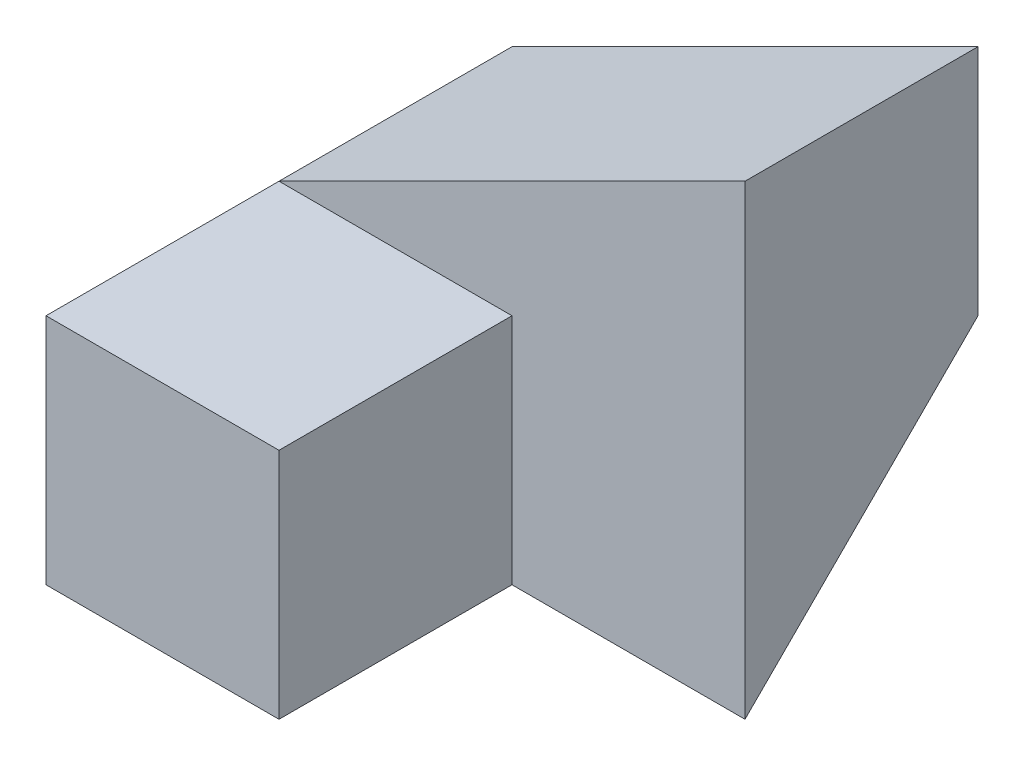
ISO-10303-21;
HEADER;
FILE_DESCRIPTION(('STEP AP214'),'2;1');
FILE_NAME('part.step','',(''),(''),'','','');
FILE_SCHEMA(('AUTOMOTIVE_DESIGN { 1 0 10303 214 1 1 1 1 }'));
ENDSEC;
DATA;
#1=APPLICATION_CONTEXT('core data for automotive mechanical design processes');
#2=APPLICATION_PROTOCOL_DEFINITION('international standard','automotive_design',2000,#1);
#3=PRODUCT_CONTEXT('',#1,'mechanical');
#4=PRODUCT('Part','Part','',(#3));
#5=PRODUCT_RELATED_PRODUCT_CATEGORY('part','',(#4));
#6=PRODUCT_DEFINITION_FORMATION('','',#4);
#7=PRODUCT_DEFINITION_CONTEXT('part definition',#1,'design');
#8=PRODUCT_DEFINITION('design','',#6,#7);
#9=PRODUCT_DEFINITION_SHAPE('','',#8);
#10=(LENGTH_UNIT() NAMED_UNIT(*) SI_UNIT(.MILLI.,.METRE.));
#11=(NAMED_UNIT(*) PLANE_ANGLE_UNIT() SI_UNIT($,.RADIAN.));
#12=(NAMED_UNIT(*) SI_UNIT($,.STERADIAN.) SOLID_ANGLE_UNIT());
#13=UNCERTAINTY_MEASURE_WITH_UNIT(LENGTH_MEASURE(1.E-05),#10,'distance_accuracy_value','');
#14=(GEOMETRIC_REPRESENTATION_CONTEXT(3) GLOBAL_UNCERTAINTY_ASSIGNED_CONTEXT((#13)) GLOBAL_UNIT_ASSIGNED_CONTEXT((#10,
#11,#12)) REPRESENTATION_CONTEXT('',''));
#15=CARTESIAN_POINT('',(0.,0.,0.));
#16=DIRECTION('',(0.,0.,1.));
#17=DIRECTION('',(1.,0.,0.));
#18=AXIS2_PLACEMENT_3D('',#15,#16,#17);
#19=CARTESIAN_POINT('',(0.,0.,40.));
#20=DIRECTION('',(1.,0.,0.));
#21=DIRECTION('',(0.,0.,-1.));
#22=AXIS2_PLACEMENT_3D('',#19,#20,#21);
#23=PLANE('',#22);
#24=DIRECTION('',(0.,0.,1.));
#25=VECTOR('',#24,1.);
#26=CARTESIAN_POINT('',(0.,20.,0.));
#27=LINE('',#26,#25);
#28=CARTESIAN_POINT('',(0.,20.,0.));
#29=VERTEX_POINT('',#28);
#30=CARTESIAN_POINT('',(0.,20.,20.));
#31=VERTEX_POINT('',#30);
#32=EDGE_CURVE('E114',#29,#31,#27,.T.);
#33=ORIENTED_EDGE('',*,*,#32,.F.);
#34=DIRECTION('',(0.,0.707106781186548,-0.707106781186548));
#35=VECTOR('',#34,1.);
#36=CARTESIAN_POINT('',(0.,20.,0.));
#37=LINE('',#36,#35);
#38=CARTESIAN_POINT('',(0.,0.,20.));
#39=VERTEX_POINT('',#38);
#40=EDGE_CURVE('E96',#39,#29,#37,.T.);
#41=ORIENTED_EDGE('',*,*,#40,.F.);
#42=DIRECTION('',(0.,0.,-1.));
#43=VECTOR('',#42,1.);
#44=CARTESIAN_POINT('',(0.,0.,40.));
#45=LINE('',#44,#43);
#46=CARTESIAN_POINT('',(0.,0.,40.));
#47=VERTEX_POINT('',#46);
#48=EDGE_CURVE('E40',#47,#39,#45,.T.);
#49=ORIENTED_EDGE('',*,*,#48,.F.);
#50=DIRECTION('',(0.,-1.,0.));
#51=VECTOR('',#50,1.);
#52=CARTESIAN_POINT('',(0.,0.,40.));
#53=LINE('',#52,#51);
#54=CARTESIAN_POINT('',(0.,20.,40.));
#55=VERTEX_POINT('',#54);
#56=EDGE_CURVE('E56',#55,#47,#53,.T.);
#57=ORIENTED_EDGE('',*,*,#56,.F.);
#58=DIRECTION('',(0.,0.,-1.));
#59=VECTOR('',#58,1.);
#60=CARTESIAN_POINT('',(0.,20.,40.));
#61=LINE('',#60,#59);
#62=EDGE_CURVE('E146',#55,#31,#61,.T.);
#63=ORIENTED_EDGE('',*,*,#62,.T.);
#64=EDGE_LOOP('',(#33,#41,#49,#57,#63));
#65=FACE_BOUND('',#64,.T.);
#66=ADVANCED_FACE('F33',(#65),#23,.F.);
#67=CARTESIAN_POINT('',(0.,0.,40.));
#68=DIRECTION('',(0.,1.,0.));
#69=DIRECTION('',(0.,0.,1.));
#70=AXIS2_PLACEMENT_3D('',#67,#68,#69);
#71=PLANE('',#70);
#72=ORIENTED_EDGE('',*,*,#48,.T.);
#73=DIRECTION('',(-1.,0.,0.));
#74=VECTOR('',#73,1.);
#75=CARTESIAN_POINT('',(40.,0.,20.));
#76=LINE('',#75,#74);
#77=CARTESIAN_POINT('',(20.,0.,20.));
#78=VERTEX_POINT('',#77);
#79=EDGE_CURVE('E102',#78,#39,#76,.T.);
#80=ORIENTED_EDGE('',*,*,#79,.F.);
#81=DIRECTION('',(0.,0.,1.));
#82=VECTOR('',#81,1.);
#83=CARTESIAN_POINT('',(20.,0.,40.));
#84=LINE('',#83,#82);
#85=CARTESIAN_POINT('',(20.,0.,40.));
#86=VERTEX_POINT('',#85);
#87=EDGE_CURVE('E144',#78,#86,#84,.T.);
#88=ORIENTED_EDGE('',*,*,#87,.T.);
#89=DIRECTION('',(1.,0.,0.));
#90=VECTOR('',#89,1.);
#91=CARTESIAN_POINT('',(0.,0.,40.));
#92=LINE('',#91,#90);
#93=EDGE_CURVE('E116',#47,#86,#92,.T.);
#94=ORIENTED_EDGE('',*,*,#93,.F.);
#95=EDGE_LOOP('',(#72,#80,#88,#94));
#96=FACE_BOUND('',#95,.T.);
#97=ADVANCED_FACE('F127',(#96),#71,.F.);
#98=CARTESIAN_POINT('',(40.,0.,40.));
#99=DIRECTION('',(-1.,0.,0.));
#100=DIRECTION('',(0.,0.,1.));
#101=AXIS2_PLACEMENT_3D('',#98,#99,#100);
#102=PLANE('',#101);
#103=DIRECTION('',(0.,1.,0.));
#104=VECTOR('',#103,1.);
#105=CARTESIAN_POINT('',(40.,40.,20.));
#106=LINE('',#105,#104);
#107=CARTESIAN_POINT('',(40.,0.,20.));
#108=VERTEX_POINT('',#107);
#109=CARTESIAN_POINT('',(40.,40.,20.));
#110=VERTEX_POINT('',#109);
#111=EDGE_CURVE('E109',#108,#110,#106,.T.);
#112=ORIENTED_EDGE('',*,*,#111,.F.);
#113=DIRECTION('',(0.,0.707106781186548,-0.707106781186548));
#114=VECTOR('',#113,1.);
#115=CARTESIAN_POINT('',(40.,20.,0.));
#116=LINE('',#115,#114);
#117=CARTESIAN_POINT('',(40.,20.,0.));
#118=VERTEX_POINT('',#117);
#119=EDGE_CURVE('E93',#108,#118,#116,.T.);
#120=ORIENTED_EDGE('',*,*,#119,.T.);
#121=DIRECTION('',(0.,1.,0.));
#122=VECTOR('',#121,1.);
#123=CARTESIAN_POINT('',(40.,0.,0.));
#124=LINE('',#123,#122);
#125=CARTESIAN_POINT('',(40.,40.,0.));
#126=VERTEX_POINT('',#125);
#127=EDGE_CURVE('E107',#118,#126,#124,.T.);
#128=ORIENTED_EDGE('',*,*,#127,.T.);
#129=DIRECTION('',(0.,0.,-1.));
#130=VECTOR('',#129,1.);
#131=CARTESIAN_POINT('',(40.,40.,40.));
#132=LINE('',#131,#130);
#133=EDGE_CURVE('E122',#110,#126,#132,.T.);
#134=ORIENTED_EDGE('',*,*,#133,.F.);
#135=EDGE_LOOP('',(#112,#120,#128,#134));
#136=FACE_BOUND('',#135,.T.);
#137=ADVANCED_FACE('F105',(#136),#102,.F.);
#138=CARTESIAN_POINT('',(0.,0.,40.));
#139=DIRECTION('',(0.,0.,-1.));
#140=DIRECTION('',(-1.,0.,0.));
#141=AXIS2_PLACEMENT_3D('',#138,#139,#140);
#142=PLANE('',#141);
#143=ORIENTED_EDGE('',*,*,#93,.T.);
#144=DIRECTION('',(0.,1.,0.));
#145=VECTOR('',#144,1.);
#146=CARTESIAN_POINT('',(20.,-20.,40.));
#147=LINE('',#146,#145);
#148=CARTESIAN_POINT('',(20.,20.,40.));
#149=VERTEX_POINT('',#148);
#150=EDGE_CURVE('E137',#86,#149,#147,.T.);
#151=ORIENTED_EDGE('',*,*,#150,.T.);
#152=DIRECTION('',(1.,0.,0.));
#153=VECTOR('',#152,1.);
#154=CARTESIAN_POINT('',(0.,20.,40.));
#155=LINE('',#154,#153);
#156=EDGE_CURVE('E148',#55,#149,#155,.T.);
#157=ORIENTED_EDGE('',*,*,#156,.F.);
#158=ORIENTED_EDGE('',*,*,#56,.T.);
#159=EDGE_LOOP('',(#143,#151,#157,#158));
#160=FACE_BOUND('',#159,.T.);
#161=ADVANCED_FACE('F154',(#160),#142,.F.);
#162=CARTESIAN_POINT('',(0.,0.,0.));
#163=DIRECTION('',(0.,0.,-1.));
#164=DIRECTION('',(-1.,0.,0.));
#165=AXIS2_PLACEMENT_3D('',#162,#163,#164);
#166=PLANE('',#165);
#167=DIRECTION('',(-1.,0.,0.));
#168=VECTOR('',#167,1.);
#169=CARTESIAN_POINT('',(40.,20.,0.));
#170=LINE('',#169,#168);
#171=EDGE_CURVE('E90',#118,#29,#170,.T.);
#172=ORIENTED_EDGE('',*,*,#171,.T.);
#173=DIRECTION('',(0.894427190999916,0.447213595499958,0.));
#174=VECTOR('',#173,1.);
#175=CARTESIAN_POINT('',(40.,40.,0.));
#176=LINE('',#175,#174);
#177=EDGE_CURVE('E113',#29,#126,#176,.T.);
#178=ORIENTED_EDGE('',*,*,#177,.T.);
#179=ORIENTED_EDGE('',*,*,#127,.F.);
#180=EDGE_LOOP('',(#172,#178,#179));
#181=FACE_BOUND('',#180,.T.);
#182=ADVANCED_FACE('F112',(#181),#166,.T.);
#183=CARTESIAN_POINT('',(40.,40.,0.));
#184=DIRECTION('',(0.447213595499958,-0.894427190999916,0.));
#185=DIRECTION('',(0.894427190999916,0.447213595499958,0.));
#186=AXIS2_PLACEMENT_3D('',#183,#184,#185);
#187=PLANE('',#186);
#188=ORIENTED_EDGE('',*,*,#32,.T.);
#189=DIRECTION('',(0.894427190999916,0.447213595499958,0.));
#190=VECTOR('',#189,1.);
#191=CARTESIAN_POINT('',(40.,40.,20.));
#192=LINE('',#191,#190);
#193=EDGE_CURVE('E11',#31,#110,#192,.T.);
#194=ORIENTED_EDGE('',*,*,#193,.T.);
#195=ORIENTED_EDGE('',*,*,#133,.T.);
#196=ORIENTED_EDGE('',*,*,#177,.F.);
#197=EDGE_LOOP('',(#188,#194,#195,#196));
#198=FACE_BOUND('',#197,.T.);
#199=ADVANCED_FACE('F161',(#198),#187,.F.);
#200=CARTESIAN_POINT('',(0.,40.,20.));
#201=DIRECTION('',(0.,0.,-1.));
#202=DIRECTION('',(0.,1.,0.));
#203=AXIS2_PLACEMENT_3D('',#200,#201,#202);
#204=PLANE('',#203);
#205=DIRECTION('',(1.,0.,0.));
#206=VECTOR('',#205,1.);
#207=CARTESIAN_POINT('',(0.,20.,20.));
#208=LINE('',#207,#206);
#209=CARTESIAN_POINT('',(20.,20.,20.));
#210=VERTEX_POINT('',#209);
#211=EDGE_CURVE('E47',#31,#210,#208,.T.);
#212=ORIENTED_EDGE('',*,*,#211,.T.);
#213=DIRECTION('',(0.,1.,0.));
#214=VECTOR('',#213,1.);
#215=CARTESIAN_POINT('',(20.,-20.,20.));
#216=LINE('',#215,#214);
#217=EDGE_CURVE('E138',#78,#210,#216,.T.);
#218=ORIENTED_EDGE('',*,*,#217,.F.);
#219=DIRECTION('',(-1.,0.,0.));
#220=VECTOR('',#219,1.);
#221=CARTESIAN_POINT('',(0.,0.,20.));
#222=LINE('',#221,#220);
#223=EDGE_CURVE('E140',#108,#78,#222,.T.);
#224=ORIENTED_EDGE('',*,*,#223,.F.);
#225=ORIENTED_EDGE('',*,*,#111,.T.);
#226=ORIENTED_EDGE('',*,*,#193,.F.);
#227=EDGE_LOOP('',(#212,#218,#224,#225,#226));
#228=FACE_BOUND('',#227,.T.);
#229=ADVANCED_FACE('F159',(#228),#204,.F.);
#230=CARTESIAN_POINT('',(0.,20.,40.));
#231=DIRECTION('',(0.,-1.,0.));
#232=DIRECTION('',(0.,0.,-1.));
#233=AXIS2_PLACEMENT_3D('',#230,#231,#232);
#234=PLANE('',#233);
#235=ORIENTED_EDGE('',*,*,#156,.T.);
#236=DIRECTION('',(0.,0.,1.));
#237=VECTOR('',#236,1.);
#238=CARTESIAN_POINT('',(20.,20.,20.));
#239=LINE('',#238,#237);
#240=EDGE_CURVE('E101',#210,#149,#239,.T.);
#241=ORIENTED_EDGE('',*,*,#240,.F.);
#242=ORIENTED_EDGE('',*,*,#211,.F.);
#243=ORIENTED_EDGE('',*,*,#62,.F.);
#244=EDGE_LOOP('',(#235,#241,#242,#243));
#245=FACE_BOUND('',#244,.T.);
#246=ADVANCED_FACE('F153',(#245),#234,.F.);
#247=CARTESIAN_POINT('',(20.,-20.,20.));
#248=DIRECTION('',(-1.,0.,0.));
#249=DIRECTION('',(0.,0.,1.));
#250=AXIS2_PLACEMENT_3D('',#247,#248,#249);
#251=PLANE('',#250);
#252=ORIENTED_EDGE('',*,*,#217,.T.);
#253=ORIENTED_EDGE('',*,*,#240,.T.);
#254=ORIENTED_EDGE('',*,*,#150,.F.);
#255=ORIENTED_EDGE('',*,*,#87,.F.);
#256=EDGE_LOOP('',(#252,#253,#254,#255));
#257=FACE_BOUND('',#256,.T.);
#258=ADVANCED_FACE('F156',(#257),#251,.F.);
#259=CARTESIAN_POINT('',(40.,20.,0.));
#260=DIRECTION('',(0.,0.707106781186548,0.707106781186548));
#261=DIRECTION('',(0.,-0.707106781186548,0.707106781186548));
#262=AXIS2_PLACEMENT_3D('',#259,#260,#261);
#263=PLANE('',#262);
#264=ORIENTED_EDGE('',*,*,#40,.T.);
#265=ORIENTED_EDGE('',*,*,#171,.F.);
#266=ORIENTED_EDGE('',*,*,#119,.F.);
#267=ORIENTED_EDGE('',*,*,#223,.T.);
#268=ORIENTED_EDGE('',*,*,#79,.T.);
#269=EDGE_LOOP('',(#264,#265,#266,#267,#268));
#270=FACE_BOUND('',#269,.T.);
#271=ADVANCED_FACE('F92',(#270),#263,.F.);
#272=CLOSED_SHELL('',(#66,#97,#137,#161,#182,#199,#229,#246,#258,#271));
#273=MANIFOLD_SOLID_BREP('B2',#272);
#274=ADVANCED_BREP_SHAPE_REPRESENTATION('',(#18,#273),#14);
#275=SHAPE_DEFINITION_REPRESENTATION(#9,#274);
ENDSEC;
END-ISO-10303-21;
